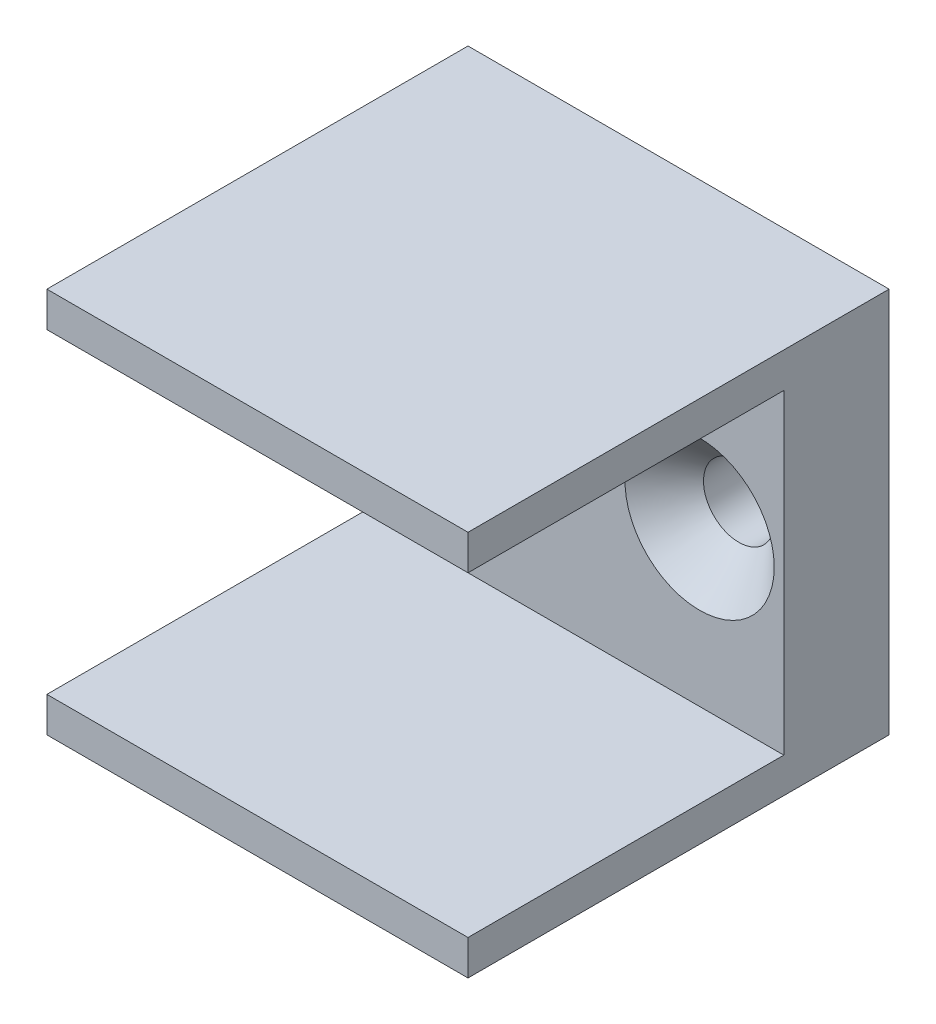
ISO-10303-21;
HEADER;
FILE_DESCRIPTION(('STEP AP214'),'2;1');
FILE_NAME('part.step','',(''),(''),'','','');
FILE_SCHEMA(('AUTOMOTIVE_DESIGN { 1 0 10303 214 1 1 1 1 }'));
ENDSEC;
DATA;
#1=APPLICATION_CONTEXT('core data for automotive mechanical design processes');
#2=APPLICATION_PROTOCOL_DEFINITION('international standard','automotive_design',2000,#1);
#3=PRODUCT_CONTEXT('',#1,'mechanical');
#4=PRODUCT('Part','Part','',(#3));
#5=PRODUCT_RELATED_PRODUCT_CATEGORY('part','',(#4));
#6=PRODUCT_DEFINITION_FORMATION('','',#4);
#7=PRODUCT_DEFINITION_CONTEXT('part definition',#1,'design');
#8=PRODUCT_DEFINITION('design','',#6,#7);
#9=PRODUCT_DEFINITION_SHAPE('','',#8);
#10=(LENGTH_UNIT() NAMED_UNIT(*) SI_UNIT(.MILLI.,.METRE.));
#11=(NAMED_UNIT(*) PLANE_ANGLE_UNIT() SI_UNIT($,.RADIAN.));
#12=(NAMED_UNIT(*) SI_UNIT($,.STERADIAN.) SOLID_ANGLE_UNIT());
#13=UNCERTAINTY_MEASURE_WITH_UNIT(LENGTH_MEASURE(1.E-05),#10,'distance_accuracy_value','');
#14=(GEOMETRIC_REPRESENTATION_CONTEXT(3) GLOBAL_UNCERTAINTY_ASSIGNED_CONTEXT((#13)) GLOBAL_UNIT_ASSIGNED_CONTEXT((#10,
#11,#12)) REPRESENTATION_CONTEXT('',''));
#15=CARTESIAN_POINT('',(0.,0.,0.));
#16=DIRECTION('',(0.,0.,1.));
#17=DIRECTION('',(1.,0.,0.));
#18=AXIS2_PLACEMENT_3D('',#15,#16,#17);
#19=CARTESIAN_POINT('',(0.,0.,19.05));
#20=DIRECTION('',(0.,0.,-1.));
#21=DIRECTION('',(-1.,0.,0.));
#22=AXIS2_PLACEMENT_3D('',#19,#20,#21);
#23=PLANE('',#22);
#24=DIRECTION('',(0.,-1.,0.));
#25=VECTOR('',#24,1.);
#26=CARTESIAN_POINT('',(-19.05,-17.4625,19.05));
#27=LINE('',#26,#25);
#28=CARTESIAN_POINT('',(-19.05,17.4625,19.05));
#29=VERTEX_POINT('',#28);
#30=CARTESIAN_POINT('',(-19.05,14.2875,19.05));
#31=VERTEX_POINT('',#30);
#32=EDGE_CURVE('E144',#29,#31,#27,.T.);
#33=ORIENTED_EDGE('',*,*,#32,.T.);
#34=DIRECTION('',(-1.,0.,0.));
#35=VECTOR('',#34,1.);
#36=CARTESIAN_POINT('',(-19.05,14.2875,19.05));
#37=LINE('',#36,#35);
#38=CARTESIAN_POINT('',(19.05,14.2875,19.05));
#39=VERTEX_POINT('',#38);
#40=EDGE_CURVE('E128',#39,#31,#37,.T.);
#41=ORIENTED_EDGE('',*,*,#40,.F.);
#42=DIRECTION('',(0.,1.,0.));
#43=VECTOR('',#42,1.);
#44=CARTESIAN_POINT('',(19.05,-17.4625,19.05));
#45=LINE('',#44,#43);
#46=CARTESIAN_POINT('',(19.05,17.4625,19.05));
#47=VERTEX_POINT('',#46);
#48=EDGE_CURVE('E90',#39,#47,#45,.T.);
#49=ORIENTED_EDGE('',*,*,#48,.T.);
#50=DIRECTION('',(-1.,0.,0.));
#51=VECTOR('',#50,1.);
#52=CARTESIAN_POINT('',(-19.05,17.4625,19.05));
#53=LINE('',#52,#51);
#54=EDGE_CURVE('E142',#47,#29,#53,.T.);
#55=ORIENTED_EDGE('',*,*,#54,.T.);
#56=EDGE_LOOP('',(#33,#41,#49,#55));
#57=FACE_BOUND('',#56,.T.);
#58=ADVANCED_FACE('F37',(#57),#23,.F.);
#59=CARTESIAN_POINT('',(19.05,-17.4625,19.05));
#60=DIRECTION('',(-1.,0.,0.));
#61=DIRECTION('',(0.,0.,1.));
#62=AXIS2_PLACEMENT_3D('',#59,#60,#61);
#63=PLANE('',#62);
#64=ORIENTED_EDGE('',*,*,#48,.F.);
#65=DIRECTION('',(0.,0.,1.));
#66=VECTOR('',#65,1.);
#67=CARTESIAN_POINT('',(19.05,14.2875,-9.525));
#68=LINE('',#67,#66);
#69=CARTESIAN_POINT('',(19.05,14.2875,-9.525));
#70=VERTEX_POINT('',#69);
#71=EDGE_CURVE('E135',#70,#39,#68,.T.);
#72=ORIENTED_EDGE('',*,*,#71,.F.);
#73=DIRECTION('',(0.,1.,0.));
#74=VECTOR('',#73,1.);
#75=CARTESIAN_POINT('',(19.05,14.2875,-9.525));
#76=LINE('',#75,#74);
#77=CARTESIAN_POINT('',(19.05,-14.2875,-9.525));
#78=VERTEX_POINT('',#77);
#79=EDGE_CURVE('E118',#78,#70,#76,.T.);
#80=ORIENTED_EDGE('',*,*,#79,.F.);
#81=DIRECTION('',(0.,0.,1.));
#82=VECTOR('',#81,1.);
#83=CARTESIAN_POINT('',(19.05,-14.2875,-9.525));
#84=LINE('',#83,#82);
#85=CARTESIAN_POINT('',(19.05,-14.2875,19.05));
#86=VERTEX_POINT('',#85);
#87=EDGE_CURVE('E115',#78,#86,#84,.T.);
#88=ORIENTED_EDGE('',*,*,#87,.T.);
#89=CARTESIAN_POINT('',(19.05,-17.4625,19.05));
#90=VERTEX_POINT('',#89);
#91=EDGE_CURVE('E140',#90,#86,#45,.T.);
#92=ORIENTED_EDGE('',*,*,#91,.F.);
#93=DIRECTION('',(0.,0.,-1.));
#94=VECTOR('',#93,1.);
#95=CARTESIAN_POINT('',(19.05,-17.4625,19.05));
#96=LINE('',#95,#94);
#97=CARTESIAN_POINT('',(19.05,-17.4625,-19.05));
#98=VERTEX_POINT('',#97);
#99=EDGE_CURVE('E148',#90,#98,#96,.T.);
#100=ORIENTED_EDGE('',*,*,#99,.T.);
#101=DIRECTION('',(0.,1.,0.));
#102=VECTOR('',#101,1.);
#103=CARTESIAN_POINT('',(19.05,-17.4625,-19.05));
#104=LINE('',#103,#102);
#105=CARTESIAN_POINT('',(19.05,17.4625,-19.05));
#106=VERTEX_POINT('',#105);
#107=EDGE_CURVE('E149',#98,#106,#104,.T.);
#108=ORIENTED_EDGE('',*,*,#107,.T.);
#109=DIRECTION('',(0.,0.,-1.));
#110=VECTOR('',#109,1.);
#111=CARTESIAN_POINT('',(19.05,17.4625,19.05));
#112=LINE('',#111,#110);
#113=EDGE_CURVE('E11',#47,#106,#112,.T.);
#114=ORIENTED_EDGE('',*,*,#113,.F.);
#115=EDGE_LOOP('',(#64,#72,#80,#88,#92,#100,#108,#114));
#116=FACE_BOUND('',#115,.T.);
#117=ADVANCED_FACE('F39',(#116),#63,.F.);
#118=CARTESIAN_POINT('',(-19.05,17.4625,19.05));
#119=DIRECTION('',(0.,-1.,0.));
#120=DIRECTION('',(0.,0.,-1.));
#121=AXIS2_PLACEMENT_3D('',#118,#119,#120);
#122=PLANE('',#121);
#123=DIRECTION('',(-1.,0.,0.));
#124=VECTOR('',#123,1.);
#125=CARTESIAN_POINT('',(-19.05,17.4625,-19.05));
#126=LINE('',#125,#124);
#127=CARTESIAN_POINT('',(-19.05,17.4625,-19.05));
#128=VERTEX_POINT('',#127);
#129=EDGE_CURVE('E152',#106,#128,#126,.T.);
#130=ORIENTED_EDGE('',*,*,#129,.T.);
#131=DIRECTION('',(0.,0.,-1.));
#132=VECTOR('',#131,1.);
#133=CARTESIAN_POINT('',(-19.05,17.4625,19.05));
#134=LINE('',#133,#132);
#135=EDGE_CURVE('E45',#29,#128,#134,.T.);
#136=ORIENTED_EDGE('',*,*,#135,.F.);
#137=ORIENTED_EDGE('',*,*,#54,.F.);
#138=ORIENTED_EDGE('',*,*,#113,.T.);
#139=EDGE_LOOP('',(#130,#136,#137,#138));
#140=FACE_BOUND('',#139,.T.);
#141=ADVANCED_FACE('F180',(#140),#122,.F.);
#142=CARTESIAN_POINT('',(-19.05,-17.4625,19.05));
#143=DIRECTION('',(1.,0.,0.));
#144=DIRECTION('',(0.,0.,-1.));
#145=AXIS2_PLACEMENT_3D('',#142,#143,#144);
#146=PLANE('',#145);
#147=DIRECTION('',(0.,-1.,0.));
#148=VECTOR('',#147,1.);
#149=CARTESIAN_POINT('',(-19.05,14.2875,-9.525));
#150=LINE('',#149,#148);
#151=CARTESIAN_POINT('',(-19.05,14.2875,-9.525));
#152=VERTEX_POINT('',#151);
#153=CARTESIAN_POINT('',(-19.05,-14.2875,-9.525));
#154=VERTEX_POINT('',#153);
#155=EDGE_CURVE('E119',#152,#154,#150,.T.);
#156=ORIENTED_EDGE('',*,*,#155,.F.);
#157=DIRECTION('',(0.,0.,1.));
#158=VECTOR('',#157,1.);
#159=CARTESIAN_POINT('',(-19.05,14.2875,-9.525));
#160=LINE('',#159,#158);
#161=EDGE_CURVE('E153',#152,#31,#160,.T.);
#162=ORIENTED_EDGE('',*,*,#161,.T.);
#163=ORIENTED_EDGE('',*,*,#32,.F.);
#164=ORIENTED_EDGE('',*,*,#135,.T.);
#165=DIRECTION('',(0.,-1.,0.));
#166=VECTOR('',#165,1.);
#167=CARTESIAN_POINT('',(-19.05,-17.4625,-19.05));
#168=LINE('',#167,#166);
#169=CARTESIAN_POINT('',(-19.05,-17.4625,-19.05));
#170=VERTEX_POINT('',#169);
#171=EDGE_CURVE('E155',#128,#170,#168,.T.);
#172=ORIENTED_EDGE('',*,*,#171,.T.);
#173=DIRECTION('',(0.,0.,-1.));
#174=VECTOR('',#173,1.);
#175=CARTESIAN_POINT('',(-19.05,-17.4625,19.05));
#176=LINE('',#175,#174);
#177=CARTESIAN_POINT('',(-19.05,-17.4625,19.05));
#178=VERTEX_POINT('',#177);
#179=EDGE_CURVE('E159',#178,#170,#176,.T.);
#180=ORIENTED_EDGE('',*,*,#179,.F.);
#181=CARTESIAN_POINT('',(-19.05,-14.2875,19.05));
#182=VERTEX_POINT('',#181);
#183=EDGE_CURVE('E133',#182,#178,#27,.T.);
#184=ORIENTED_EDGE('',*,*,#183,.F.);
#185=DIRECTION('',(0.,0.,1.));
#186=VECTOR('',#185,1.);
#187=CARTESIAN_POINT('',(-19.05,-14.2875,-9.525));
#188=LINE('',#187,#186);
#189=EDGE_CURVE('E52',#154,#182,#188,.T.);
#190=ORIENTED_EDGE('',*,*,#189,.F.);
#191=EDGE_LOOP('',(#156,#162,#163,#164,#172,#180,#184,#190));
#192=FACE_BOUND('',#191,.T.);
#193=ADVANCED_FACE('F131',(#192),#146,.F.);
#194=CARTESIAN_POINT('',(-19.05,-17.4625,19.05));
#195=DIRECTION('',(0.,1.,0.));
#196=DIRECTION('',(0.,0.,1.));
#197=AXIS2_PLACEMENT_3D('',#194,#195,#196);
#198=PLANE('',#197);
#199=DIRECTION('',(1.,0.,0.));
#200=VECTOR('',#199,1.);
#201=CARTESIAN_POINT('',(-19.05,-17.4625,-19.05));
#202=LINE('',#201,#200);
#203=EDGE_CURVE('E82',#170,#98,#202,.T.);
#204=ORIENTED_EDGE('',*,*,#203,.T.);
#205=ORIENTED_EDGE('',*,*,#99,.F.);
#206=DIRECTION('',(1.,0.,0.));
#207=VECTOR('',#206,1.);
#208=CARTESIAN_POINT('',(-19.05,-17.4625,19.05));
#209=LINE('',#208,#207);
#210=EDGE_CURVE('E61',#178,#90,#209,.T.);
#211=ORIENTED_EDGE('',*,*,#210,.F.);
#212=ORIENTED_EDGE('',*,*,#179,.T.);
#213=EDGE_LOOP('',(#204,#205,#211,#212));
#214=FACE_BOUND('',#213,.T.);
#215=ADVANCED_FACE('F171',(#214),#198,.F.);
#216=ORIENTED_EDGE('',*,*,#91,.T.);
#217=DIRECTION('',(1.,0.,0.));
#218=VECTOR('',#217,1.);
#219=CARTESIAN_POINT('',(-19.05,-14.2875,19.05));
#220=LINE('',#219,#218);
#221=EDGE_CURVE('E204',#182,#86,#220,.T.);
#222=ORIENTED_EDGE('',*,*,#221,.F.);
#223=ORIENTED_EDGE('',*,*,#183,.T.);
#224=ORIENTED_EDGE('',*,*,#210,.T.);
#225=EDGE_LOOP('',(#216,#222,#223,#224));
#226=FACE_BOUND('',#225,.T.);
#227=ADVANCED_FACE('F173',(#226),#23,.F.);
#228=CARTESIAN_POINT('',(0.,0.,-19.05));
#229=DIRECTION('',(0.,0.,-1.));
#230=DIRECTION('',(-1.,0.,0.));
#231=AXIS2_PLACEMENT_3D('',#228,#229,#230);
#232=PLANE('',#231);
#233=CARTESIAN_POINT('',(-11.43,0.,-19.05));
#234=DIRECTION('',(0.,0.,1.));
#235=DIRECTION('',(1.,0.,0.));
#236=AXIS2_PLACEMENT_3D('',#233,#234,#235);
#237=CIRCLE('',#236,3.2);
#238=CARTESIAN_POINT('',(-8.23000000000001,0.,-19.05));
#239=VERTEX_POINT('',#238);
#240=EDGE_CURVE('E199',#239,#239,#237,.T.);
#241=ORIENTED_EDGE('',*,*,#240,.T.);
#242=EDGE_LOOP('',(#241));
#243=FACE_BOUND('',#242,.T.);
#244=CARTESIAN_POINT('',(11.43,0.,-19.05));
#245=DIRECTION('',(0.,0.,1.));
#246=DIRECTION('',(1.,0.,0.));
#247=AXIS2_PLACEMENT_3D('',#244,#245,#246);
#248=CIRCLE('',#247,3.2);
#249=CARTESIAN_POINT('',(14.63,0.,-19.05));
#250=VERTEX_POINT('',#249);
#251=EDGE_CURVE('E202',#250,#250,#248,.T.);
#252=ORIENTED_EDGE('',*,*,#251,.T.);
#253=EDGE_LOOP('',(#252));
#254=FACE_BOUND('',#253,.T.);
#255=ORIENTED_EDGE('',*,*,#107,.F.);
#256=ORIENTED_EDGE('',*,*,#203,.F.);
#257=ORIENTED_EDGE('',*,*,#171,.F.);
#258=ORIENTED_EDGE('',*,*,#129,.F.);
#259=EDGE_LOOP('',(#255,#256,#257,#258));
#260=FACE_BOUND('',#259,.T.);
#261=ADVANCED_FACE('F167',(#243,#254,#260),#232,.T.);
#262=CARTESIAN_POINT('',(-19.05,14.2875,-9.525));
#263=DIRECTION('',(0.,1.,0.));
#264=DIRECTION('',(0.,0.,1.));
#265=AXIS2_PLACEMENT_3D('',#262,#263,#264);
#266=PLANE('',#265);
#267=ORIENTED_EDGE('',*,*,#40,.T.);
#268=ORIENTED_EDGE('',*,*,#161,.F.);
#269=DIRECTION('',(-1.,0.,0.));
#270=VECTOR('',#269,1.);
#271=CARTESIAN_POINT('',(-19.05,14.2875,-9.525));
#272=LINE('',#271,#270);
#273=EDGE_CURVE('E125',#70,#152,#272,.T.);
#274=ORIENTED_EDGE('',*,*,#273,.F.);
#275=ORIENTED_EDGE('',*,*,#71,.T.);
#276=EDGE_LOOP('',(#267,#268,#274,#275));
#277=FACE_BOUND('',#276,.T.);
#278=ADVANCED_FACE('F190',(#277),#266,.F.);
#279=CARTESIAN_POINT('',(-19.05,-14.2875,-9.525));
#280=DIRECTION('',(0.,-1.,0.));
#281=DIRECTION('',(0.,0.,-1.));
#282=AXIS2_PLACEMENT_3D('',#279,#280,#281);
#283=PLANE('',#282);
#284=ORIENTED_EDGE('',*,*,#221,.T.);
#285=ORIENTED_EDGE('',*,*,#87,.F.);
#286=DIRECTION('',(1.,0.,0.));
#287=VECTOR('',#286,1.);
#288=CARTESIAN_POINT('',(-19.05,-14.2875,-9.525));
#289=LINE('',#288,#287);
#290=EDGE_CURVE('E111',#154,#78,#289,.T.);
#291=ORIENTED_EDGE('',*,*,#290,.F.);
#292=ORIENTED_EDGE('',*,*,#189,.T.);
#293=EDGE_LOOP('',(#284,#285,#291,#292));
#294=FACE_BOUND('',#293,.T.);
#295=ADVANCED_FACE('F113',(#294),#283,.F.);
#296=CARTESIAN_POINT('',(0.,0.,-9.525));
#297=DIRECTION('',(0.,0.,1.));
#298=DIRECTION('',(1.,0.,0.));
#299=AXIS2_PLACEMENT_3D('',#296,#297,#298);
#300=PLANE('',#299);
#301=CARTESIAN_POINT('',(-11.43,0.,-9.525));
#302=DIRECTION('',(0.,0.,1.));
#303=DIRECTION('',(1.,0.,0.));
#304=AXIS2_PLACEMENT_3D('',#301,#302,#303);
#305=CIRCLE('',#304,6.75);
#306=CARTESIAN_POINT('',(-4.68000000000001,0.,-9.525));
#307=VERTEX_POINT('',#306);
#308=EDGE_CURVE('E310',#307,#307,#305,.T.);
#309=ORIENTED_EDGE('',*,*,#308,.F.);
#310=EDGE_LOOP('',(#309));
#311=FACE_BOUND('',#310,.T.);
#312=CARTESIAN_POINT('',(11.43,0.,-9.525));
#313=DIRECTION('',(0.,0.,1.));
#314=DIRECTION('',(1.,0.,0.));
#315=AXIS2_PLACEMENT_3D('',#312,#313,#314);
#316=CIRCLE('',#315,6.75);
#317=CARTESIAN_POINT('',(18.18,0.,-9.525));
#318=VERTEX_POINT('',#317);
#319=EDGE_CURVE('E209',#318,#318,#316,.T.);
#320=ORIENTED_EDGE('',*,*,#319,.F.);
#321=EDGE_LOOP('',(#320));
#322=FACE_BOUND('',#321,.T.);
#323=ORIENTED_EDGE('',*,*,#155,.T.);
#324=ORIENTED_EDGE('',*,*,#290,.T.);
#325=ORIENTED_EDGE('',*,*,#79,.T.);
#326=ORIENTED_EDGE('',*,*,#273,.T.);
#327=EDGE_LOOP('',(#323,#324,#325,#326));
#328=FACE_BOUND('',#327,.T.);
#329=ADVANCED_FACE('F123',(#311,#322,#328),#300,.T.);
#330=CARTESIAN_POINT('',(11.43,0.,-9.525));
#331=DIRECTION('',(0.,0.,1.));
#332=DIRECTION('',(1.,0.,0.));
#333=AXIS2_PLACEMENT_3D('',#330,#331,#332);
#334=CYLINDRICAL_SURFACE('',#333,3.2);
#335=ORIENTED_EDGE('',*,*,#251,.F.);
#336=EDGE_LOOP('',(#335));
#337=FACE_BOUND('',#336,.T.);
#338=CARTESIAN_POINT('',(11.43,0.,-13.075));
#339=DIRECTION('',(0.,0.,1.));
#340=DIRECTION('',(1.,0.,0.));
#341=AXIS2_PLACEMENT_3D('',#338,#339,#340);
#342=CIRCLE('',#341,3.2);
#343=CARTESIAN_POINT('',(14.63,0.,-13.075));
#344=VERTEX_POINT('',#343);
#345=EDGE_CURVE('E205',#344,#344,#342,.T.);
#346=ORIENTED_EDGE('',*,*,#345,.T.);
#347=EDGE_LOOP('',(#346));
#348=FACE_BOUND('',#347,.T.);
#349=ADVANCED_FACE('F261',(#337,#348),#334,.F.);
#350=CARTESIAN_POINT('',(11.43,0.,-9.525));
#351=DIRECTION('',(0.,0.,1.));
#352=DIRECTION('',(1.,0.,0.));
#353=AXIS2_PLACEMENT_3D('',#350,#351,#352);
#354=CONICAL_SURFACE('',#353,6.75,0.785398163397448);
#355=ORIENTED_EDGE('',*,*,#345,.F.);
#356=EDGE_LOOP('',(#355));
#357=FACE_BOUND('',#356,.T.);
#358=ORIENTED_EDGE('',*,*,#319,.T.);
#359=EDGE_LOOP('',(#358));
#360=FACE_BOUND('',#359,.T.);
#361=ADVANCED_FACE('F271',(#357,#360),#354,.F.);
#362=CARTESIAN_POINT('',(-11.43,0.,-9.525));
#363=DIRECTION('',(0.,0.,1.));
#364=DIRECTION('',(1.,0.,0.));
#365=AXIS2_PLACEMENT_3D('',#362,#363,#364);
#366=CYLINDRICAL_SURFACE('',#365,3.2);
#367=ORIENTED_EDGE('',*,*,#240,.F.);
#368=EDGE_LOOP('',(#367));
#369=FACE_BOUND('',#368,.T.);
#370=CARTESIAN_POINT('',(-11.43,0.,-13.075));
#371=DIRECTION('',(0.,0.,1.));
#372=DIRECTION('',(1.,0.,0.));
#373=AXIS2_PLACEMENT_3D('',#370,#371,#372);
#374=CIRCLE('',#373,3.2);
#375=CARTESIAN_POINT('',(-8.23000000000001,0.,-13.075));
#376=VERTEX_POINT('',#375);
#377=EDGE_CURVE('E307',#376,#376,#374,.T.);
#378=ORIENTED_EDGE('',*,*,#377,.T.);
#379=EDGE_LOOP('',(#378));
#380=FACE_BOUND('',#379,.T.);
#381=ADVANCED_FACE('F280',(#369,#380),#366,.F.);
#382=CARTESIAN_POINT('',(-11.43,0.,-9.525));
#383=DIRECTION('',(0.,0.,1.));
#384=DIRECTION('',(1.,0.,0.));
#385=AXIS2_PLACEMENT_3D('',#382,#383,#384);
#386=CONICAL_SURFACE('',#385,6.75,0.785398163397448);
#387=ORIENTED_EDGE('',*,*,#377,.F.);
#388=EDGE_LOOP('',(#387));
#389=FACE_BOUND('',#388,.T.);
#390=ORIENTED_EDGE('',*,*,#308,.T.);
#391=EDGE_LOOP('',(#390));
#392=FACE_BOUND('',#391,.T.);
#393=ADVANCED_FACE('F290',(#389,#392),#386,.F.);
#394=CLOSED_SHELL('',(#58,#117,#141,#193,#215,#227,#261,#278,#295,#329,#349,#361,#381,#393));
#395=MANIFOLD_SOLID_BREP('B2',#394);
#396=ADVANCED_BREP_SHAPE_REPRESENTATION('',(#18,#395),#14);
#397=SHAPE_DEFINITION_REPRESENTATION(#9,#396);
ENDSEC;
END-ISO-10303-21;
